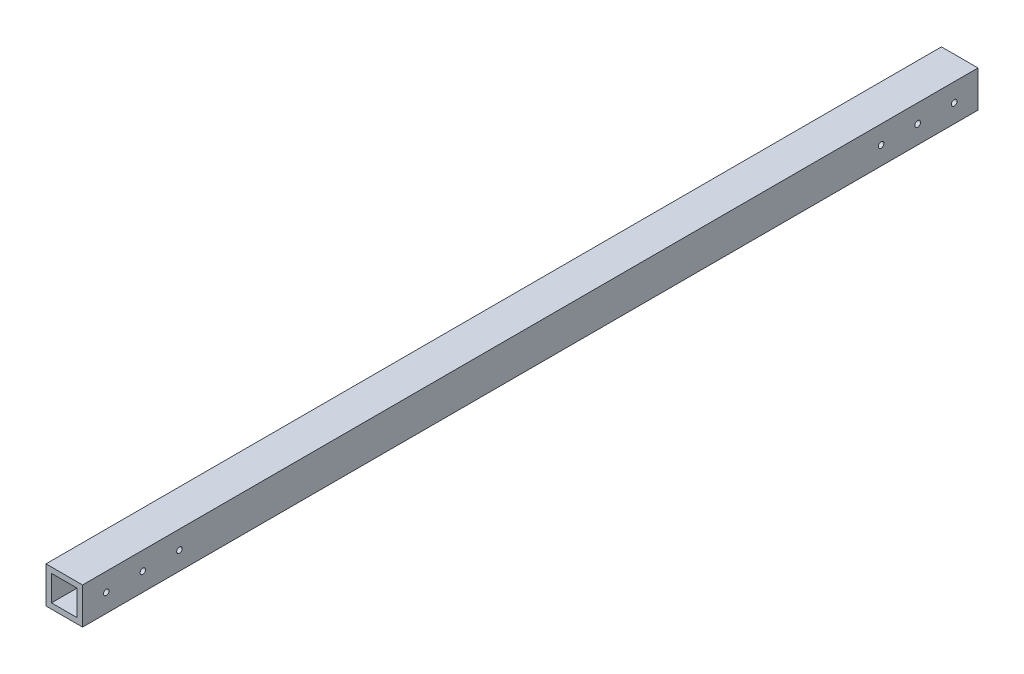
ISO-10303-21;
HEADER;
FILE_DESCRIPTION(('STEP AP214'),'2;1');
FILE_NAME('part.step','',(''),(''),'','','');
FILE_SCHEMA(('AUTOMOTIVE_DESIGN { 1 0 10303 214 1 1 1 1 }'));
ENDSEC;
DATA;
#1=APPLICATION_CONTEXT('core data for automotive mechanical design processes');
#2=APPLICATION_PROTOCOL_DEFINITION('international standard','automotive_design',2000,#1);
#3=PRODUCT_CONTEXT('',#1,'mechanical');
#4=PRODUCT('Part','Part','',(#3));
#5=PRODUCT_RELATED_PRODUCT_CATEGORY('part','',(#4));
#6=PRODUCT_DEFINITION_FORMATION('','',#4);
#7=PRODUCT_DEFINITION_CONTEXT('part definition',#1,'design');
#8=PRODUCT_DEFINITION('design','',#6,#7);
#9=PRODUCT_DEFINITION_SHAPE('','',#8);
#10=(LENGTH_UNIT() NAMED_UNIT(*) SI_UNIT(.MILLI.,.METRE.));
#11=(NAMED_UNIT(*) PLANE_ANGLE_UNIT() SI_UNIT($,.RADIAN.));
#12=(NAMED_UNIT(*) SI_UNIT($,.STERADIAN.) SOLID_ANGLE_UNIT());
#13=UNCERTAINTY_MEASURE_WITH_UNIT(LENGTH_MEASURE(1.E-05),#10,'distance_accuracy_value','');
#14=(GEOMETRIC_REPRESENTATION_CONTEXT(3) GLOBAL_UNCERTAINTY_ASSIGNED_CONTEXT((#13)) GLOBAL_UNIT_ASSIGNED_CONTEXT((#10,
#11,#12)) REPRESENTATION_CONTEXT('',''));
#15=CARTESIAN_POINT('',(0.,0.,0.));
#16=DIRECTION('',(0.,0.,1.));
#17=DIRECTION('',(1.,0.,0.));
#18=AXIS2_PLACEMENT_3D('',#15,#16,#17);
#19=CARTESIAN_POINT('',(-9.33333333333334,11.0061476485938,490.));
#20=DIRECTION('',(0.,-1.,0.));
#21=DIRECTION('',(1.,0.,0.));
#22=AXIS2_PLACEMENT_3D('',#19,#20,#21);
#23=PLANE('',#22);
#24=DIRECTION('',(-1.,0.,0.));
#25=VECTOR('',#24,1.);
#26=CARTESIAN_POINT('',(-9.33333333333334,11.0061476485938,0.));
#27=LINE('',#26,#25);
#28=CARTESIAN_POINT('',(10.6666666666667,11.0061476485938,0.));
#29=VERTEX_POINT('',#28);
#30=CARTESIAN_POINT('',(-9.33333333333334,11.0061476485938,0.));
#31=VERTEX_POINT('',#30);
#32=EDGE_CURVE('E141',#29,#31,#27,.T.);
#33=ORIENTED_EDGE('',*,*,#32,.T.);
#34=DIRECTION('',(0.,0.,-1.));
#35=VECTOR('',#34,1.);
#36=CARTESIAN_POINT('',(-9.33333333333334,11.0061476485938,490.));
#37=LINE('',#36,#35);
#38=CARTESIAN_POINT('',(-9.33333333333334,11.0061476485938,490.));
#39=VERTEX_POINT('',#38);
#40=EDGE_CURVE('E11',#39,#31,#37,.T.);
#41=ORIENTED_EDGE('',*,*,#40,.F.);
#42=DIRECTION('',(-1.,0.,0.));
#43=VECTOR('',#42,1.);
#44=CARTESIAN_POINT('',(-9.33333333333334,11.0061476485938,490.));
#45=LINE('',#44,#43);
#46=CARTESIAN_POINT('',(10.6666666666667,11.0061476485938,490.));
#47=VERTEX_POINT('',#46);
#48=EDGE_CURVE('E145',#47,#39,#45,.T.);
#49=ORIENTED_EDGE('',*,*,#48,.F.);
#50=DIRECTION('',(0.,0.,-1.));
#51=VECTOR('',#50,1.);
#52=CARTESIAN_POINT('',(10.6666666666667,11.0061476485938,490.));
#53=LINE('',#52,#51);
#54=EDGE_CURVE('E155',#47,#29,#53,.T.);
#55=ORIENTED_EDGE('',*,*,#54,.T.);
#56=EDGE_LOOP('',(#33,#41,#49,#55));
#57=FACE_BOUND('',#56,.T.);
#58=ADVANCED_FACE('F39',(#57),#23,.F.);
#59=CARTESIAN_POINT('',(-9.33333333333334,11.0061476485938,490.));
#60=DIRECTION('',(1.,0.,0.));
#61=DIRECTION('',(0.,0.,-1.));
#62=AXIS2_PLACEMENT_3D('',#59,#60,#61);
#63=PLANE('',#62);
#64=CARTESIAN_POINT('',(-9.33333333333334,1.00614764859214,12.9999999999969));
#65=DIRECTION('',(-1.,0.,0.));
#66=DIRECTION('',(0.,0.,1.));
#67=AXIS2_PLACEMENT_3D('',#64,#65,#66);
#68=CIRCLE('',#67,1.54999999999875);
#69=CARTESIAN_POINT('',(-9.33333333333334,1.00614764859214,14.5499999999957));
#70=VERTEX_POINT('',#69);
#71=EDGE_CURVE('E188',#70,#70,#68,.T.);
#72=ORIENTED_EDGE('',*,*,#71,.F.);
#73=EDGE_LOOP('',(#72));
#74=FACE_BOUND('',#73,.T.);
#75=CARTESIAN_POINT('',(-9.33333333333334,1.00614764859208,32.9999999999969));
#76=DIRECTION('',(-1.,0.,0.));
#77=DIRECTION('',(0.,0.,1.));
#78=AXIS2_PLACEMENT_3D('',#75,#76,#77);
#79=CIRCLE('',#78,1.54999999999875);
#80=CARTESIAN_POINT('',(-9.33333333333334,1.00614764859208,34.5499999999957));
#81=VERTEX_POINT('',#80);
#82=EDGE_CURVE('E545',#81,#81,#79,.T.);
#83=ORIENTED_EDGE('',*,*,#82,.F.);
#84=EDGE_LOOP('',(#83));
#85=FACE_BOUND('',#84,.T.);
#86=CARTESIAN_POINT('',(-9.33333333333334,1.006147648592,52.9999999999937));
#87=DIRECTION('',(-1.,0.,0.));
#88=DIRECTION('',(0.,0.,1.));
#89=AXIS2_PLACEMENT_3D('',#86,#87,#88);
#90=CIRCLE('',#89,1.54999999999969);
#91=CARTESIAN_POINT('',(-9.33333333333334,1.006147648592,54.5499999999934));
#92=VERTEX_POINT('',#91);
#93=EDGE_CURVE('E548',#92,#92,#90,.T.);
#94=ORIENTED_EDGE('',*,*,#93,.F.);
#95=EDGE_LOOP('',(#94));
#96=FACE_BOUND('',#95,.T.);
#97=CARTESIAN_POINT('',(-9.33333333333334,1.00614764859378,477.));
#98=DIRECTION('',(1.,0.,0.));
#99=DIRECTION('',(0.,0.,-1.));
#100=AXIS2_PLACEMENT_3D('',#97,#98,#99);
#101=CIRCLE('',#100,1.50000000000002);
#102=CARTESIAN_POINT('',(-9.33333333333334,1.00614764859378,475.5));
#103=VERTEX_POINT('',#102);
#104=EDGE_CURVE('E129',#103,#103,#101,.T.);
#105=ORIENTED_EDGE('',*,*,#104,.T.);
#106=EDGE_LOOP('',(#105));
#107=FACE_BOUND('',#106,.T.);
#108=CARTESIAN_POINT('',(-9.33333333333334,1.00614764859379,457.));
#109=DIRECTION('',(1.,0.,0.));
#110=DIRECTION('',(0.,0.,-1.));
#111=AXIS2_PLACEMENT_3D('',#108,#109,#110);
#112=CIRCLE('',#111,1.50000000000002);
#113=CARTESIAN_POINT('',(-9.33333333333334,1.00614764859379,455.5));
#114=VERTEX_POINT('',#113);
#115=EDGE_CURVE('E184',#114,#114,#112,.T.);
#116=ORIENTED_EDGE('',*,*,#115,.T.);
#117=EDGE_LOOP('',(#116));
#118=FACE_BOUND('',#117,.T.);
#119=CARTESIAN_POINT('',(-9.33333333333334,1.00614764859379,437.));
#120=DIRECTION('',(1.,0.,0.));
#121=DIRECTION('',(0.,0.,-1.));
#122=AXIS2_PLACEMENT_3D('',#119,#120,#121);
#123=CIRCLE('',#122,1.49999999999997);
#124=CARTESIAN_POINT('',(-9.33333333333334,1.00614764859379,435.5));
#125=VERTEX_POINT('',#124);
#126=EDGE_CURVE('E179',#125,#125,#123,.T.);
#127=ORIENTED_EDGE('',*,*,#126,.T.);
#128=EDGE_LOOP('',(#127));
#129=FACE_BOUND('',#128,.T.);
#130=DIRECTION('',(0.,-1.,0.));
#131=VECTOR('',#130,1.);
#132=CARTESIAN_POINT('',(-9.33333333333334,11.0061476485938,0.));
#133=LINE('',#132,#131);
#134=CARTESIAN_POINT('',(-9.33333333333334,-8.99385235140616,0.));
#135=VERTEX_POINT('',#134);
#136=EDGE_CURVE('E158',#31,#135,#133,.T.);
#137=ORIENTED_EDGE('',*,*,#136,.T.);
#138=DIRECTION('',(0.,0.,-1.));
#139=VECTOR('',#138,1.);
#140=CARTESIAN_POINT('',(-9.33333333333334,-8.99385235140616,490.));
#141=LINE('',#140,#139);
#142=CARTESIAN_POINT('',(-9.33333333333334,-8.99385235140616,490.));
#143=VERTEX_POINT('',#142);
#144=EDGE_CURVE('E47',#143,#135,#141,.T.);
#145=ORIENTED_EDGE('',*,*,#144,.F.);
#146=DIRECTION('',(0.,-1.,0.));
#147=VECTOR('',#146,1.);
#148=CARTESIAN_POINT('',(-9.33333333333334,11.0061476485938,490.));
#149=LINE('',#148,#147);
#150=EDGE_CURVE('E148',#39,#143,#149,.T.);
#151=ORIENTED_EDGE('',*,*,#150,.F.);
#152=ORIENTED_EDGE('',*,*,#40,.T.);
#153=EDGE_LOOP('',(#137,#145,#151,#152));
#154=FACE_BOUND('',#153,.T.);
#155=ADVANCED_FACE('F235',(#74,#85,#96,#107,#118,#129,#154),#63,.F.);
#156=CARTESIAN_POINT('',(-9.33333333333334,-8.99385235140616,490.));
#157=DIRECTION('',(0.,1.,0.));
#158=DIRECTION('',(-1.,0.,0.));
#159=AXIS2_PLACEMENT_3D('',#156,#157,#158);
#160=PLANE('',#159);
#161=DIRECTION('',(1.,0.,0.));
#162=VECTOR('',#161,1.);
#163=CARTESIAN_POINT('',(-9.33333333333334,-8.99385235140616,0.));
#164=LINE('',#163,#162);
#165=CARTESIAN_POINT('',(10.6666666666667,-8.99385235140615,0.));
#166=VERTEX_POINT('',#165);
#167=EDGE_CURVE('E160',#135,#166,#164,.T.);
#168=ORIENTED_EDGE('',*,*,#167,.T.);
#169=DIRECTION('',(0.,0.,-1.));
#170=VECTOR('',#169,1.);
#171=CARTESIAN_POINT('',(10.6666666666667,-8.99385235140615,490.));
#172=LINE('',#171,#170);
#173=CARTESIAN_POINT('',(10.6666666666667,-8.99385235140615,490.));
#174=VERTEX_POINT('',#173);
#175=EDGE_CURVE('E165',#174,#166,#172,.T.);
#176=ORIENTED_EDGE('',*,*,#175,.F.);
#177=DIRECTION('',(1.,0.,0.));
#178=VECTOR('',#177,1.);
#179=CARTESIAN_POINT('',(-9.33333333333334,-8.99385235140616,490.));
#180=LINE('',#179,#178);
#181=EDGE_CURVE('E151',#143,#174,#180,.T.);
#182=ORIENTED_EDGE('',*,*,#181,.F.);
#183=ORIENTED_EDGE('',*,*,#144,.T.);
#184=EDGE_LOOP('',(#168,#176,#182,#183));
#185=FACE_BOUND('',#184,.T.);
#186=ADVANCED_FACE('F266',(#185),#160,.F.);
#187=CARTESIAN_POINT('',(10.6666666666667,11.0061476485938,490.));
#188=DIRECTION('',(-1.,0.,0.));
#189=DIRECTION('',(0.,-1.,0.));
#190=AXIS2_PLACEMENT_3D('',#187,#188,#189);
#191=PLANE('',#190);
#192=CARTESIAN_POINT('',(10.6666666666667,1.00614764859214,12.9999999999969));
#193=DIRECTION('',(-1.,0.,0.));
#194=DIRECTION('',(0.,-1.,0.));
#195=AXIS2_PLACEMENT_3D('',#192,#193,#194);
#196=CIRCLE('',#195,1.54999999999875);
#197=CARTESIAN_POINT('',(10.6666666666667,-0.543852351406609,12.9999999999969));
#198=VERTEX_POINT('',#197);
#199=EDGE_CURVE('E211',#198,#198,#196,.T.);
#200=ORIENTED_EDGE('',*,*,#199,.T.);
#201=EDGE_LOOP('',(#200));
#202=FACE_BOUND('',#201,.T.);
#203=CARTESIAN_POINT('',(10.6666666666667,1.00614764859208,32.9999999999969));
#204=DIRECTION('',(-1.,0.,0.));
#205=DIRECTION('',(0.,-1.,0.));
#206=AXIS2_PLACEMENT_3D('',#203,#204,#205);
#207=CIRCLE('',#206,1.54999999999875);
#208=CARTESIAN_POINT('',(10.6666666666667,-0.543852351406664,32.9999999999969));
#209=VERTEX_POINT('',#208);
#210=EDGE_CURVE('E196',#209,#209,#207,.T.);
#211=ORIENTED_EDGE('',*,*,#210,.T.);
#212=EDGE_LOOP('',(#211));
#213=FACE_BOUND('',#212,.T.);
#214=CARTESIAN_POINT('',(10.6666666666667,1.006147648592,52.9999999999937));
#215=DIRECTION('',(-1.,0.,0.));
#216=DIRECTION('',(0.,-1.,0.));
#217=AXIS2_PLACEMENT_3D('',#214,#215,#216);
#218=CIRCLE('',#217,1.54999999999969);
#219=CARTESIAN_POINT('',(10.6666666666667,-0.543852351407691,52.9999999999937));
#220=VERTEX_POINT('',#219);
#221=EDGE_CURVE('E192',#220,#220,#218,.T.);
#222=ORIENTED_EDGE('',*,*,#221,.T.);
#223=EDGE_LOOP('',(#222));
#224=FACE_BOUND('',#223,.T.);
#225=CARTESIAN_POINT('',(10.6666666666667,1.00614764859379,477.));
#226=DIRECTION('',(1.,0.,0.));
#227=DIRECTION('',(0.,1.,0.));
#228=AXIS2_PLACEMENT_3D('',#225,#226,#227);
#229=CIRCLE('',#228,1.50000000000002);
#230=CARTESIAN_POINT('',(10.6666666666667,2.50614764859381,477.));
#231=VERTEX_POINT('',#230);
#232=EDGE_CURVE('E174',#231,#231,#229,.T.);
#233=ORIENTED_EDGE('',*,*,#232,.F.);
#234=EDGE_LOOP('',(#233));
#235=FACE_BOUND('',#234,.T.);
#236=CARTESIAN_POINT('',(10.6666666666667,1.00614764859379,457.));
#237=DIRECTION('',(1.,0.,0.));
#238=DIRECTION('',(0.,1.,0.));
#239=AXIS2_PLACEMENT_3D('',#236,#237,#238);
#240=CIRCLE('',#239,1.50000000000002);
#241=CARTESIAN_POINT('',(10.6666666666667,2.50614764859382,457.));
#242=VERTEX_POINT('',#241);
#243=EDGE_CURVE('E217',#242,#242,#240,.T.);
#244=ORIENTED_EDGE('',*,*,#243,.F.);
#245=EDGE_LOOP('',(#244));
#246=FACE_BOUND('',#245,.T.);
#247=CARTESIAN_POINT('',(10.6666666666667,1.0061476485938,437.));
#248=DIRECTION('',(1.,0.,0.));
#249=DIRECTION('',(0.,1.,0.));
#250=AXIS2_PLACEMENT_3D('',#247,#248,#249);
#251=CIRCLE('',#250,1.49999999999997);
#252=CARTESIAN_POINT('',(10.6666666666667,2.50614764859377,437.));
#253=VERTEX_POINT('',#252);
#254=EDGE_CURVE('E214',#253,#253,#251,.T.);
#255=ORIENTED_EDGE('',*,*,#254,.F.);
#256=EDGE_LOOP('',(#255));
#257=FACE_BOUND('',#256,.T.);
#258=DIRECTION('',(0.,1.,0.));
#259=VECTOR('',#258,1.);
#260=CARTESIAN_POINT('',(10.6666666666667,11.0061476485938,0.));
#261=LINE('',#260,#259);
#262=EDGE_CURVE('E149',#166,#29,#261,.T.);
#263=ORIENTED_EDGE('',*,*,#262,.T.);
#264=ORIENTED_EDGE('',*,*,#54,.F.);
#265=DIRECTION('',(0.,1.,0.));
#266=VECTOR('',#265,1.);
#267=CARTESIAN_POINT('',(10.6666666666667,11.0061476485938,490.));
#268=LINE('',#267,#266);
#269=EDGE_CURVE('E153',#174,#47,#268,.T.);
#270=ORIENTED_EDGE('',*,*,#269,.F.);
#271=ORIENTED_EDGE('',*,*,#175,.T.);
#272=EDGE_LOOP('',(#263,#264,#270,#271));
#273=FACE_BOUND('',#272,.T.);
#274=ADVANCED_FACE('F282',(#202,#213,#224,#235,#246,#257,#273),#191,.F.);
#275=CARTESIAN_POINT('',(0.,0.,490.));
#276=DIRECTION('',(0.,0.,-1.));
#277=DIRECTION('',(-1.,0.,0.));
#278=AXIS2_PLACEMENT_3D('',#275,#276,#277);
#279=PLANE('',#278);
#280=DIRECTION('',(1.,0.,0.));
#281=VECTOR('',#280,1.);
#282=CARTESIAN_POINT('',(7.66666666666666,8.00614764859384,490.));
#283=LINE('',#282,#281);
#284=CARTESIAN_POINT('',(-6.33333333333334,8.00614764859384,490.));
#285=VERTEX_POINT('',#284);
#286=CARTESIAN_POINT('',(7.66666666666666,8.00614764859384,490.));
#287=VERTEX_POINT('',#286);
#288=EDGE_CURVE('E113',#285,#287,#283,.T.);
#289=ORIENTED_EDGE('',*,*,#288,.T.);
#290=DIRECTION('',(0.,-1.,0.));
#291=VECTOR('',#290,1.);
#292=CARTESIAN_POINT('',(7.66666666666666,8.00614764859384,490.));
#293=LINE('',#292,#291);
#294=CARTESIAN_POINT('',(7.66666666666666,-5.99385235140616,490.));
#295=VERTEX_POINT('',#294);
#296=EDGE_CURVE('E107',#287,#295,#293,.T.);
#297=ORIENTED_EDGE('',*,*,#296,.T.);
#298=DIRECTION('',(-1.,0.,0.));
#299=VECTOR('',#298,1.);
#300=CARTESIAN_POINT('',(7.66666666666666,-5.99385235140616,490.));
#301=LINE('',#300,#299);
#302=CARTESIAN_POINT('',(-6.33333333333334,-5.99385235140616,490.));
#303=VERTEX_POINT('',#302);
#304=EDGE_CURVE('E116',#295,#303,#301,.T.);
#305=ORIENTED_EDGE('',*,*,#304,.T.);
#306=DIRECTION('',(0.,1.,0.));
#307=VECTOR('',#306,1.);
#308=CARTESIAN_POINT('',(-6.33333333333334,8.00614764859384,490.));
#309=LINE('',#308,#307);
#310=EDGE_CURVE('E55',#303,#285,#309,.T.);
#311=ORIENTED_EDGE('',*,*,#310,.T.);
#312=EDGE_LOOP('',(#289,#297,#305,#311));
#313=FACE_BOUND('',#312,.T.);
#314=ORIENTED_EDGE('',*,*,#48,.T.);
#315=ORIENTED_EDGE('',*,*,#150,.T.);
#316=ORIENTED_EDGE('',*,*,#181,.T.);
#317=ORIENTED_EDGE('',*,*,#269,.T.);
#318=EDGE_LOOP('',(#314,#315,#316,#317));
#319=FACE_BOUND('',#318,.T.);
#320=ADVANCED_FACE('F120',(#313,#319),#279,.F.);
#321=CARTESIAN_POINT('',(0.,0.,0.));
#322=DIRECTION('',(0.,0.,-1.));
#323=DIRECTION('',(-1.,0.,0.));
#324=AXIS2_PLACEMENT_3D('',#321,#322,#323);
#325=PLANE('',#324);
#326=DIRECTION('',(0.,-1.,0.));
#327=VECTOR('',#326,1.);
#328=CARTESIAN_POINT('',(7.66666666666666,8.00614764859384,0.));
#329=LINE('',#328,#327);
#330=CARTESIAN_POINT('',(7.66666666666666,8.00614764859384,0.));
#331=VERTEX_POINT('',#330);
#332=CARTESIAN_POINT('',(7.66666666666666,-5.99385235140616,0.));
#333=VERTEX_POINT('',#332);
#334=EDGE_CURVE('E63',#331,#333,#329,.T.);
#335=ORIENTED_EDGE('',*,*,#334,.F.);
#336=DIRECTION('',(1.,0.,0.));
#337=VECTOR('',#336,1.);
#338=CARTESIAN_POINT('',(7.66666666666666,8.00614764859384,0.));
#339=LINE('',#338,#337);
#340=CARTESIAN_POINT('',(-6.33333333333334,8.00614764859384,0.));
#341=VERTEX_POINT('',#340);
#342=EDGE_CURVE('E123',#341,#331,#339,.T.);
#343=ORIENTED_EDGE('',*,*,#342,.F.);
#344=DIRECTION('',(0.,1.,0.));
#345=VECTOR('',#344,1.);
#346=CARTESIAN_POINT('',(-6.33333333333334,8.00614764859384,0.));
#347=LINE('',#346,#345);
#348=CARTESIAN_POINT('',(-6.33333333333334,-5.99385235140616,0.));
#349=VERTEX_POINT('',#348);
#350=EDGE_CURVE('E126',#349,#341,#347,.T.);
#351=ORIENTED_EDGE('',*,*,#350,.F.);
#352=DIRECTION('',(-1.,0.,0.));
#353=VECTOR('',#352,1.);
#354=CARTESIAN_POINT('',(7.66666666666666,-5.99385235140616,0.));
#355=LINE('',#354,#353);
#356=EDGE_CURVE('E135',#333,#349,#355,.T.);
#357=ORIENTED_EDGE('',*,*,#356,.F.);
#358=EDGE_LOOP('',(#335,#343,#351,#357));
#359=FACE_BOUND('',#358,.T.);
#360=ORIENTED_EDGE('',*,*,#32,.F.);
#361=ORIENTED_EDGE('',*,*,#262,.F.);
#362=ORIENTED_EDGE('',*,*,#167,.F.);
#363=ORIENTED_EDGE('',*,*,#136,.F.);
#364=EDGE_LOOP('',(#360,#361,#362,#363));
#365=FACE_BOUND('',#364,.T.);
#366=ADVANCED_FACE('F274',(#359,#365),#325,.T.);
#367=CARTESIAN_POINT('',(7.66666666666666,8.00614764859384,490.));
#368=DIRECTION('',(1.,0.,0.));
#369=DIRECTION('',(0.,1.,0.));
#370=AXIS2_PLACEMENT_3D('',#367,#368,#369);
#371=PLANE('',#370);
#372=CARTESIAN_POINT('',(7.66666666666666,1.00614764859214,12.9999999999969));
#373=DIRECTION('',(1.,0.,0.));
#374=DIRECTION('',(0.,1.,0.));
#375=AXIS2_PLACEMENT_3D('',#372,#373,#374);
#376=CIRCLE('',#375,1.54999999999875);
#377=CARTESIAN_POINT('',(7.66666666666666,2.55614764859088,12.9999999999969));
#378=VERTEX_POINT('',#377);
#379=EDGE_CURVE('E208',#378,#378,#376,.T.);
#380=ORIENTED_EDGE('',*,*,#379,.T.);
#381=EDGE_LOOP('',(#380));
#382=FACE_BOUND('',#381,.T.);
#383=CARTESIAN_POINT('',(7.66666666666666,1.00614764859208,32.9999999999969));
#384=DIRECTION('',(1.,0.,0.));
#385=DIRECTION('',(0.,1.,0.));
#386=AXIS2_PLACEMENT_3D('',#383,#384,#385);
#387=CIRCLE('',#386,1.54999999999875);
#388=CARTESIAN_POINT('',(7.66666666666666,2.55614764859083,32.9999999999969));
#389=VERTEX_POINT('',#388);
#390=EDGE_CURVE('E191',#389,#389,#387,.T.);
#391=ORIENTED_EDGE('',*,*,#390,.T.);
#392=EDGE_LOOP('',(#391));
#393=FACE_BOUND('',#392,.T.);
#394=CARTESIAN_POINT('',(7.66666666666666,1.006147648592,52.9999999999937));
#395=DIRECTION('',(1.,0.,0.));
#396=DIRECTION('',(0.,1.,0.));
#397=AXIS2_PLACEMENT_3D('',#394,#395,#396);
#398=CIRCLE('',#397,1.54999999999969);
#399=CARTESIAN_POINT('',(7.66666666666666,2.55614764859169,52.9999999999937));
#400=VERTEX_POINT('',#399);
#401=EDGE_CURVE('E187',#400,#400,#398,.T.);
#402=ORIENTED_EDGE('',*,*,#401,.T.);
#403=EDGE_LOOP('',(#402));
#404=FACE_BOUND('',#403,.T.);
#405=CARTESIAN_POINT('',(7.66666666666666,1.00614764859379,477.));
#406=DIRECTION('',(1.,0.,0.));
#407=DIRECTION('',(0.,1.,0.));
#408=AXIS2_PLACEMENT_3D('',#405,#406,#407);
#409=CIRCLE('',#408,1.50000000000002);
#410=CARTESIAN_POINT('',(7.66666666666666,2.50614764859381,477.));
#411=VERTEX_POINT('',#410);
#412=EDGE_CURVE('E183',#411,#411,#409,.T.);
#413=ORIENTED_EDGE('',*,*,#412,.T.);
#414=EDGE_LOOP('',(#413));
#415=FACE_BOUND('',#414,.T.);
#416=CARTESIAN_POINT('',(7.66666666666666,1.00614764859379,457.));
#417=DIRECTION('',(1.,0.,0.));
#418=DIRECTION('',(0.,1.,0.));
#419=AXIS2_PLACEMENT_3D('',#416,#417,#418);
#420=CIRCLE('',#419,1.50000000000002);
#421=CARTESIAN_POINT('',(7.66666666666666,2.50614764859382,457.));
#422=VERTEX_POINT('',#421);
#423=EDGE_CURVE('E178',#422,#422,#420,.T.);
#424=ORIENTED_EDGE('',*,*,#423,.T.);
#425=EDGE_LOOP('',(#424));
#426=FACE_BOUND('',#425,.T.);
#427=CARTESIAN_POINT('',(7.66666666666666,1.0061476485938,437.));
#428=DIRECTION('',(1.,0.,0.));
#429=DIRECTION('',(0.,1.,0.));
#430=AXIS2_PLACEMENT_3D('',#427,#428,#429);
#431=CIRCLE('',#430,1.49999999999997);
#432=CARTESIAN_POINT('',(7.66666666666666,2.50614764859377,437.));
#433=VERTEX_POINT('',#432);
#434=EDGE_CURVE('E173',#433,#433,#431,.T.);
#435=ORIENTED_EDGE('',*,*,#434,.T.);
#436=EDGE_LOOP('',(#435));
#437=FACE_BOUND('',#436,.T.);
#438=ORIENTED_EDGE('',*,*,#334,.T.);
#439=DIRECTION('',(0.,0.,-1.));
#440=VECTOR('',#439,1.);
#441=CARTESIAN_POINT('',(7.66666666666666,-5.99385235140616,490.));
#442=LINE('',#441,#440);
#443=EDGE_CURVE('E103',#295,#333,#442,.T.);
#444=ORIENTED_EDGE('',*,*,#443,.F.);
#445=ORIENTED_EDGE('',*,*,#296,.F.);
#446=DIRECTION('',(0.,0.,-1.));
#447=VECTOR('',#446,1.);
#448=CARTESIAN_POINT('',(7.66666666666666,8.00614764859384,490.));
#449=LINE('',#448,#447);
#450=EDGE_CURVE('E139',#287,#331,#449,.T.);
#451=ORIENTED_EDGE('',*,*,#450,.T.);
#452=EDGE_LOOP('',(#438,#444,#445,#451));
#453=FACE_BOUND('',#452,.T.);
#454=ADVANCED_FACE('F105',(#382,#393,#404,#415,#426,#437,#453),#371,.F.);
#455=CARTESIAN_POINT('',(7.66666666666666,8.00614764859384,490.));
#456=DIRECTION('',(0.,1.,0.));
#457=DIRECTION('',(0.,0.,1.));
#458=AXIS2_PLACEMENT_3D('',#455,#456,#457);
#459=PLANE('',#458);
#460=ORIENTED_EDGE('',*,*,#342,.T.);
#461=ORIENTED_EDGE('',*,*,#450,.F.);
#462=ORIENTED_EDGE('',*,*,#288,.F.);
#463=DIRECTION('',(0.,0.,-1.));
#464=VECTOR('',#463,1.);
#465=CARTESIAN_POINT('',(-6.33333333333334,8.00614764859384,490.));
#466=LINE('',#465,#464);
#467=EDGE_CURVE('E142',#285,#341,#466,.T.);
#468=ORIENTED_EDGE('',*,*,#467,.T.);
#469=EDGE_LOOP('',(#460,#461,#462,#468));
#470=FACE_BOUND('',#469,.T.);
#471=ADVANCED_FACE('F300',(#470),#459,.F.);
#472=CARTESIAN_POINT('',(-6.33333333333334,8.00614764859384,490.));
#473=DIRECTION('',(-1.,0.,0.));
#474=DIRECTION('',(0.,0.,1.));
#475=AXIS2_PLACEMENT_3D('',#472,#473,#474);
#476=PLANE('',#475);
#477=CARTESIAN_POINT('',(-6.33333333333334,1.00614764859214,12.9999999999969));
#478=DIRECTION('',(-1.,0.,0.));
#479=DIRECTION('',(0.,0.,1.));
#480=AXIS2_PLACEMENT_3D('',#477,#478,#479);
#481=CIRCLE('',#480,1.54999999999875);
#482=CARTESIAN_POINT('',(-6.33333333333334,1.00614764859214,14.5499999999957));
#483=VERTEX_POINT('',#482);
#484=EDGE_CURVE('E42',#483,#483,#481,.T.);
#485=ORIENTED_EDGE('',*,*,#484,.T.);
#486=EDGE_LOOP('',(#485));
#487=FACE_BOUND('',#486,.T.);
#488=CARTESIAN_POINT('',(-6.33333333333334,1.00614764859208,32.9999999999969));
#489=DIRECTION('',(-1.,0.,0.));
#490=DIRECTION('',(0.,0.,1.));
#491=AXIS2_PLACEMENT_3D('',#488,#489,#490);
#492=CIRCLE('',#491,1.54999999999875);
#493=CARTESIAN_POINT('',(-6.33333333333334,1.00614764859208,34.5499999999957));
#494=VERTEX_POINT('',#493);
#495=EDGE_CURVE('E189',#494,#494,#492,.T.);
#496=ORIENTED_EDGE('',*,*,#495,.T.);
#497=EDGE_LOOP('',(#496));
#498=FACE_BOUND('',#497,.T.);
#499=CARTESIAN_POINT('',(-6.33333333333334,1.006147648592,52.9999999999937));
#500=DIRECTION('',(-1.,0.,0.));
#501=DIRECTION('',(0.,0.,1.));
#502=AXIS2_PLACEMENT_3D('',#499,#500,#501);
#503=CIRCLE('',#502,1.54999999999969);
#504=CARTESIAN_POINT('',(-6.33333333333334,1.006147648592,54.5499999999934));
#505=VERTEX_POINT('',#504);
#506=EDGE_CURVE('E185',#505,#505,#503,.T.);
#507=ORIENTED_EDGE('',*,*,#506,.T.);
#508=EDGE_LOOP('',(#507));
#509=FACE_BOUND('',#508,.T.);
#510=CARTESIAN_POINT('',(-6.33333333333334,1.00614764859378,477.));
#511=DIRECTION('',(-1.,0.,0.));
#512=DIRECTION('',(0.,0.,1.));
#513=AXIS2_PLACEMENT_3D('',#510,#511,#512);
#514=CIRCLE('',#513,1.50000000000002);
#515=CARTESIAN_POINT('',(-6.33333333333334,1.00614764859378,478.5));
#516=VERTEX_POINT('',#515);
#517=EDGE_CURVE('E180',#516,#516,#514,.T.);
#518=ORIENTED_EDGE('',*,*,#517,.T.);
#519=EDGE_LOOP('',(#518));
#520=FACE_BOUND('',#519,.T.);
#521=CARTESIAN_POINT('',(-6.33333333333334,1.00614764859379,457.));
#522=DIRECTION('',(-1.,0.,0.));
#523=DIRECTION('',(0.,0.,1.));
#524=AXIS2_PLACEMENT_3D('',#521,#522,#523);
#525=CIRCLE('',#524,1.50000000000002);
#526=CARTESIAN_POINT('',(-6.33333333333334,1.00614764859379,458.5));
#527=VERTEX_POINT('',#526);
#528=EDGE_CURVE('E175',#527,#527,#525,.T.);
#529=ORIENTED_EDGE('',*,*,#528,.T.);
#530=EDGE_LOOP('',(#529));
#531=FACE_BOUND('',#530,.T.);
#532=CARTESIAN_POINT('',(-6.33333333333334,1.00614764859379,437.));
#533=DIRECTION('',(-1.,0.,0.));
#534=DIRECTION('',(0.,0.,1.));
#535=AXIS2_PLACEMENT_3D('',#532,#533,#534);
#536=CIRCLE('',#535,1.49999999999997);
#537=CARTESIAN_POINT('',(-6.33333333333334,1.00614764859379,438.5));
#538=VERTEX_POINT('',#537);
#539=EDGE_CURVE('E170',#538,#538,#536,.T.);
#540=ORIENTED_EDGE('',*,*,#539,.T.);
#541=EDGE_LOOP('',(#540));
#542=FACE_BOUND('',#541,.T.);
#543=ORIENTED_EDGE('',*,*,#350,.T.);
#544=ORIENTED_EDGE('',*,*,#467,.F.);
#545=ORIENTED_EDGE('',*,*,#310,.F.);
#546=DIRECTION('',(0.,0.,-1.));
#547=VECTOR('',#546,1.);
#548=CARTESIAN_POINT('',(-6.33333333333334,-5.99385235140616,490.));
#549=LINE('',#548,#547);
#550=EDGE_CURVE('E112',#303,#349,#549,.T.);
#551=ORIENTED_EDGE('',*,*,#550,.T.);
#552=EDGE_LOOP('',(#543,#544,#545,#551));
#553=FACE_BOUND('',#552,.T.);
#554=ADVANCED_FACE('F304',(#487,#498,#509,#520,#531,#542,#553),#476,.F.);
#555=CARTESIAN_POINT('',(7.66666666666666,-5.99385235140616,490.));
#556=DIRECTION('',(0.,-1.,0.));
#557=DIRECTION('',(0.,0.,-1.));
#558=AXIS2_PLACEMENT_3D('',#555,#556,#557);
#559=PLANE('',#558);
#560=ORIENTED_EDGE('',*,*,#356,.T.);
#561=ORIENTED_EDGE('',*,*,#550,.F.);
#562=ORIENTED_EDGE('',*,*,#304,.F.);
#563=ORIENTED_EDGE('',*,*,#443,.T.);
#564=EDGE_LOOP('',(#560,#561,#562,#563));
#565=FACE_BOUND('',#564,.T.);
#566=ADVANCED_FACE('F117',(#565),#559,.F.);
#567=CARTESIAN_POINT('',(-69.3333333333333,1.00614764859378,437.));
#568=DIRECTION('',(1.,0.,0.));
#569=DIRECTION('',(0.,1.,0.));
#570=AXIS2_PLACEMENT_3D('',#567,#568,#569);
#571=CYLINDRICAL_SURFACE('',#570,1.49999999999997);
#572=ORIENTED_EDGE('',*,*,#539,.F.);
#573=EDGE_LOOP('',(#572));
#574=FACE_BOUND('',#573,.T.);
#575=ORIENTED_EDGE('',*,*,#126,.F.);
#576=EDGE_LOOP('',(#575));
#577=FACE_BOUND('',#576,.T.);
#578=ADVANCED_FACE('F252',(#574,#577),#571,.F.);
#579=CARTESIAN_POINT('',(-69.3333333333333,1.00614764859378,457.));
#580=DIRECTION('',(1.,0.,0.));
#581=DIRECTION('',(0.,1.,0.));
#582=AXIS2_PLACEMENT_3D('',#579,#580,#581);
#583=CYLINDRICAL_SURFACE('',#582,1.50000000000002);
#584=ORIENTED_EDGE('',*,*,#528,.F.);
#585=EDGE_LOOP('',(#584));
#586=FACE_BOUND('',#585,.T.);
#587=ORIENTED_EDGE('',*,*,#115,.F.);
#588=EDGE_LOOP('',(#587));
#589=FACE_BOUND('',#588,.T.);
#590=ADVANCED_FACE('F241',(#586,#589),#583,.F.);
#591=CARTESIAN_POINT('',(-69.3333333333333,1.00614764859377,477.));
#592=DIRECTION('',(1.,0.,0.));
#593=DIRECTION('',(0.,1.,0.));
#594=AXIS2_PLACEMENT_3D('',#591,#592,#593);
#595=CYLINDRICAL_SURFACE('',#594,1.50000000000002);
#596=ORIENTED_EDGE('',*,*,#517,.F.);
#597=EDGE_LOOP('',(#596));
#598=FACE_BOUND('',#597,.T.);
#599=ORIENTED_EDGE('',*,*,#104,.F.);
#600=EDGE_LOOP('',(#599));
#601=FACE_BOUND('',#600,.T.);
#602=ADVANCED_FACE('F238',(#598,#601),#595,.F.);
#603=ORIENTED_EDGE('',*,*,#254,.T.);
#604=EDGE_LOOP('',(#603));
#605=FACE_BOUND('',#604,.T.);
#606=ORIENTED_EDGE('',*,*,#434,.F.);
#607=EDGE_LOOP('',(#606));
#608=FACE_BOUND('',#607,.T.);
#609=ADVANCED_FACE('F240',(#605,#608),#571,.F.);
#610=ORIENTED_EDGE('',*,*,#243,.T.);
#611=EDGE_LOOP('',(#610));
#612=FACE_BOUND('',#611,.T.);
#613=ORIENTED_EDGE('',*,*,#423,.F.);
#614=EDGE_LOOP('',(#613));
#615=FACE_BOUND('',#614,.T.);
#616=ADVANCED_FACE('F249',(#612,#615),#583,.F.);
#617=ORIENTED_EDGE('',*,*,#232,.T.);
#618=EDGE_LOOP('',(#617));
#619=FACE_BOUND('',#618,.T.);
#620=ORIENTED_EDGE('',*,*,#412,.F.);
#621=EDGE_LOOP('',(#620));
#622=FACE_BOUND('',#621,.T.);
#623=ADVANCED_FACE('F244',(#619,#622),#595,.F.);
#624=CARTESIAN_POINT('',(17.6666666666667,1.006147648592,52.9999999999937));
#625=DIRECTION('',(-1.,0.,0.));
#626=DIRECTION('',(0.,0.,1.));
#627=AXIS2_PLACEMENT_3D('',#624,#625,#626);
#628=CYLINDRICAL_SURFACE('',#627,1.54999999999969);
#629=ORIENTED_EDGE('',*,*,#93,.T.);
#630=EDGE_LOOP('',(#629));
#631=FACE_BOUND('',#630,.T.);
#632=ORIENTED_EDGE('',*,*,#506,.F.);
#633=EDGE_LOOP('',(#632));
#634=FACE_BOUND('',#633,.T.);
#635=ADVANCED_FACE('F258',(#631,#634),#628,.F.);
#636=CARTESIAN_POINT('',(17.6666666666667,1.00614764859208,32.9999999999969));
#637=DIRECTION('',(-1.,0.,0.));
#638=DIRECTION('',(0.,0.,1.));
#639=AXIS2_PLACEMENT_3D('',#636,#637,#638);
#640=CYLINDRICAL_SURFACE('',#639,1.54999999999875);
#641=ORIENTED_EDGE('',*,*,#82,.T.);
#642=EDGE_LOOP('',(#641));
#643=FACE_BOUND('',#642,.T.);
#644=ORIENTED_EDGE('',*,*,#495,.F.);
#645=EDGE_LOOP('',(#644));
#646=FACE_BOUND('',#645,.T.);
#647=ADVANCED_FACE('F379',(#643,#646),#640,.F.);
#648=CARTESIAN_POINT('',(17.6666666666667,1.00614764859214,12.9999999999969));
#649=DIRECTION('',(-1.,0.,0.));
#650=DIRECTION('',(0.,0.,1.));
#651=AXIS2_PLACEMENT_3D('',#648,#649,#650);
#652=CYLINDRICAL_SURFACE('',#651,1.54999999999875);
#653=ORIENTED_EDGE('',*,*,#71,.T.);
#654=EDGE_LOOP('',(#653));
#655=FACE_BOUND('',#654,.T.);
#656=ORIENTED_EDGE('',*,*,#484,.F.);
#657=EDGE_LOOP('',(#656));
#658=FACE_BOUND('',#657,.T.);
#659=ADVANCED_FACE('F390',(#655,#658),#652,.F.);
#660=ORIENTED_EDGE('',*,*,#401,.F.);
#661=EDGE_LOOP('',(#660));
#662=FACE_BOUND('',#661,.T.);
#663=ORIENTED_EDGE('',*,*,#221,.F.);
#664=EDGE_LOOP('',(#663));
#665=FACE_BOUND('',#664,.T.);
#666=ADVANCED_FACE('F381',(#662,#665),#628,.F.);
#667=ORIENTED_EDGE('',*,*,#390,.F.);
#668=EDGE_LOOP('',(#667));
#669=FACE_BOUND('',#668,.T.);
#670=ORIENTED_EDGE('',*,*,#210,.F.);
#671=EDGE_LOOP('',(#670));
#672=FACE_BOUND('',#671,.T.);
#673=ADVANCED_FACE('F393',(#669,#672),#640,.F.);
#674=ORIENTED_EDGE('',*,*,#379,.F.);
#675=EDGE_LOOP('',(#674));
#676=FACE_BOUND('',#675,.T.);
#677=ORIENTED_EDGE('',*,*,#199,.F.);
#678=EDGE_LOOP('',(#677));
#679=FACE_BOUND('',#678,.T.);
#680=ADVANCED_FACE('F404',(#676,#679),#652,.F.);
#681=CLOSED_SHELL('',(#58,#155,#186,#274,#320,#366,#454,#471,#554,#566,#578,#590,#602,#609,#616,
#623,#635,#647,#659,#666,#673,#680));
#682=MANIFOLD_SOLID_BREP('B2',#681);
#683=ADVANCED_BREP_SHAPE_REPRESENTATION('',(#18,#682),#14);
#684=SHAPE_DEFINITION_REPRESENTATION(#9,#683);
ENDSEC;
END-ISO-10303-21;
